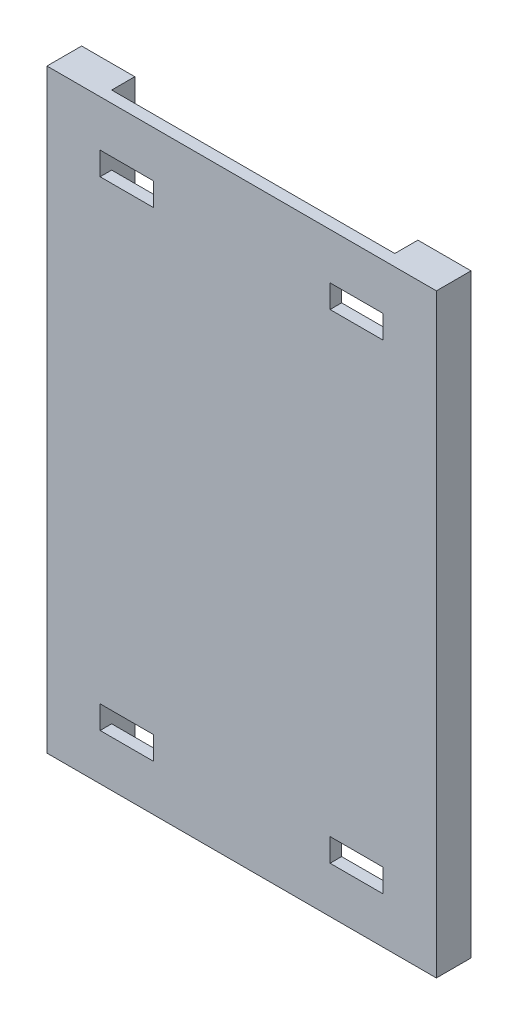
ISO-10303-21;
HEADER;
FILE_DESCRIPTION(('STEP AP214'),'2;1');
FILE_NAME('part.step','',(''),(''),'','','');
FILE_SCHEMA(('AUTOMOTIVE_DESIGN { 1 0 10303 214 1 1 1 1 }'));
ENDSEC;
DATA;
#1=APPLICATION_CONTEXT('core data for automotive mechanical design processes');
#2=APPLICATION_PROTOCOL_DEFINITION('international standard','automotive_design',2000,#1);
#3=PRODUCT_CONTEXT('',#1,'mechanical');
#4=PRODUCT('Part','Part','',(#3));
#5=PRODUCT_RELATED_PRODUCT_CATEGORY('part','',(#4));
#6=PRODUCT_DEFINITION_FORMATION('','',#4);
#7=PRODUCT_DEFINITION_CONTEXT('part definition',#1,'design');
#8=PRODUCT_DEFINITION('design','',#6,#7);
#9=PRODUCT_DEFINITION_SHAPE('','',#8);
#10=(LENGTH_UNIT() NAMED_UNIT(*) SI_UNIT(.MILLI.,.METRE.));
#11=(NAMED_UNIT(*) PLANE_ANGLE_UNIT() SI_UNIT($,.RADIAN.));
#12=(NAMED_UNIT(*) SI_UNIT($,.STERADIAN.) SOLID_ANGLE_UNIT());
#13=UNCERTAINTY_MEASURE_WITH_UNIT(LENGTH_MEASURE(1.E-05),#10,'distance_accuracy_value','');
#14=(GEOMETRIC_REPRESENTATION_CONTEXT(3) GLOBAL_UNCERTAINTY_ASSIGNED_CONTEXT((#13)) GLOBAL_UNIT_ASSIGNED_CONTEXT((#10,
#11,#12)) REPRESENTATION_CONTEXT('',''));
#15=CARTESIAN_POINT('',(0.,0.,0.));
#16=DIRECTION('',(0.,0.,1.));
#17=DIRECTION('',(1.,0.,0.));
#18=AXIS2_PLACEMENT_3D('',#15,#16,#17);
#19=CARTESIAN_POINT('',(0.,0.,-10.));
#20=DIRECTION('',(0.,0.,-1.));
#21=DIRECTION('',(-1.,0.,0.));
#22=AXIS2_PLACEMENT_3D('',#19,#20,#21);
#23=PLANE('',#22);
#24=DIRECTION('',(-1.,0.,0.));
#25=VECTOR('',#24,1.);
#26=CARTESIAN_POINT('',(69.,50.,-10.));
#27=LINE('',#26,#25);
#28=CARTESIAN_POINT('',(23.,50.,-10.));
#29=VERTEX_POINT('',#28);
#30=CARTESIAN_POINT('',(-221.999999999998,50.,-10.));
#31=VERTEX_POINT('',#30);
#32=EDGE_CURVE('E58',#29,#31,#27,.T.);
#33=ORIENTED_EDGE('',*,*,#32,.F.);
#34=DIRECTION('',(0.,1.,0.));
#35=VECTOR('',#34,1.);
#36=CARTESIAN_POINT('',(23.,-465.000000000016,-10.));
#37=LINE('',#36,#35);
#38=CARTESIAN_POINT('',(23.,10.,-10.));
#39=VERTEX_POINT('',#38);
#40=EDGE_CURVE('E225',#39,#29,#37,.T.);
#41=ORIENTED_EDGE('',*,*,#40,.F.);
#42=DIRECTION('',(-1.,0.,0.));
#43=VECTOR('',#42,1.);
#44=CARTESIAN_POINT('',(23.,10.,-10.));
#45=LINE('',#44,#43);
#46=CARTESIAN_POINT('',(-23.,10.,-10.));
#47=VERTEX_POINT('',#46);
#48=EDGE_CURVE('E251',#39,#47,#45,.T.);
#49=ORIENTED_EDGE('',*,*,#48,.T.);
#50=DIRECTION('',(0.,-1.,0.));
#51=VECTOR('',#50,1.);
#52=CARTESIAN_POINT('',(-23.,10.,-10.));
#53=LINE('',#52,#51);
#54=CARTESIAN_POINT('',(-23.,-10.,-10.));
#55=VERTEX_POINT('',#54);
#56=EDGE_CURVE('E254',#47,#55,#53,.T.);
#57=ORIENTED_EDGE('',*,*,#56,.T.);
#58=DIRECTION('',(1.,0.,0.));
#59=VECTOR('',#58,1.);
#60=CARTESIAN_POINT('',(-23.,-10.,-10.));
#61=LINE('',#60,#59);
#62=CARTESIAN_POINT('',(23.,-10.,-10.));
#63=VERTEX_POINT('',#62);
#64=EDGE_CURVE('E258',#55,#63,#61,.T.);
#65=ORIENTED_EDGE('',*,*,#64,.T.);
#66=CARTESIAN_POINT('',(23.0000000000072,-405.000000000016,-10.));
#67=VERTEX_POINT('',#66);
#68=EDGE_CURVE('E223',#67,#63,#37,.T.);
#69=ORIENTED_EDGE('',*,*,#68,.F.);
#70=DIRECTION('',(-1.,0.,0.));
#71=VECTOR('',#70,1.);
#72=CARTESIAN_POINT('',(23.0000000000072,-405.000000000016,-10.));
#73=LINE('',#72,#71);
#74=CARTESIAN_POINT('',(-22.9999999999928,-405.000000000016,-10.));
#75=VERTEX_POINT('',#74);
#76=EDGE_CURVE('E311',#67,#75,#73,.T.);
#77=ORIENTED_EDGE('',*,*,#76,.T.);
#78=DIRECTION('',(0.,-1.,0.));
#79=VECTOR('',#78,1.);
#80=CARTESIAN_POINT('',(-22.9999999999928,-405.000000000016,-10.));
#81=LINE('',#80,#79);
#82=CARTESIAN_POINT('',(-22.9999999999928,-425.000000000016,-10.));
#83=VERTEX_POINT('',#82);
#84=EDGE_CURVE('E315',#75,#83,#81,.T.);
#85=ORIENTED_EDGE('',*,*,#84,.T.);
#86=DIRECTION('',(1.,0.,0.));
#87=VECTOR('',#86,1.);
#88=CARTESIAN_POINT('',(-22.9999999999928,-425.000000000016,-10.));
#89=LINE('',#88,#87);
#90=CARTESIAN_POINT('',(23.0000000000072,-425.000000000016,-10.));
#91=VERTEX_POINT('',#90);
#92=EDGE_CURVE('E309',#83,#91,#89,.T.);
#93=ORIENTED_EDGE('',*,*,#92,.T.);
#94=CARTESIAN_POINT('',(23.,-465.000000000016,-10.));
#95=VERTEX_POINT('',#94);
#96=EDGE_CURVE('E51',#95,#91,#37,.T.);
#97=ORIENTED_EDGE('',*,*,#96,.F.);
#98=DIRECTION('',(1.,0.,0.));
#99=VECTOR('',#98,1.);
#100=CARTESIAN_POINT('',(69.,-465.000000000016,-10.));
#101=LINE('',#100,#99);
#102=CARTESIAN_POINT('',(-221.999999999998,-465.000000000016,-10.));
#103=VERTEX_POINT('',#102);
#104=EDGE_CURVE('E366',#103,#95,#101,.T.);
#105=ORIENTED_EDGE('',*,*,#104,.F.);
#106=DIRECTION('',(0.,-1.,0.));
#107=VECTOR('',#106,1.);
#108=CARTESIAN_POINT('',(-221.999999999998,-465.000000000016,-10.));
#109=LINE('',#108,#107);
#110=CARTESIAN_POINT('',(-221.999999999992,-425.000000000016,-10.));
#111=VERTEX_POINT('',#110);
#112=EDGE_CURVE('E42',#111,#103,#109,.T.);
#113=ORIENTED_EDGE('',*,*,#112,.F.);
#114=DIRECTION('',(1.,0.,0.));
#115=VECTOR('',#114,1.);
#116=CARTESIAN_POINT('',(-221.999999999992,-425.000000000016,-10.));
#117=LINE('',#116,#115);
#118=CARTESIAN_POINT('',(-175.999999999992,-425.000000000016,-10.));
#119=VERTEX_POINT('',#118);
#120=EDGE_CURVE('E337',#111,#119,#117,.T.);
#121=ORIENTED_EDGE('',*,*,#120,.T.);
#122=DIRECTION('',(0.,1.,0.));
#123=VECTOR('',#122,1.);
#124=CARTESIAN_POINT('',(-175.999999999992,-425.000000000016,-10.));
#125=LINE('',#124,#123);
#126=CARTESIAN_POINT('',(-175.999999999992,-405.000000000016,-10.));
#127=VERTEX_POINT('',#126);
#128=EDGE_CURVE('E340',#119,#127,#125,.T.);
#129=ORIENTED_EDGE('',*,*,#128,.T.);
#130=DIRECTION('',(-1.,0.,0.));
#131=VECTOR('',#130,1.);
#132=CARTESIAN_POINT('',(-175.999999999992,-405.000000000016,-10.));
#133=LINE('',#132,#131);
#134=CARTESIAN_POINT('',(-221.999999999992,-405.000000000016,-10.));
#135=VERTEX_POINT('',#134);
#136=EDGE_CURVE('E344',#127,#135,#133,.T.);
#137=ORIENTED_EDGE('',*,*,#136,.T.);
#138=CARTESIAN_POINT('',(-221.999999999998,-10.,-10.));
#139=VERTEX_POINT('',#138);
#140=EDGE_CURVE('E11',#139,#135,#109,.T.);
#141=ORIENTED_EDGE('',*,*,#140,.F.);
#142=DIRECTION('',(1.,0.,0.));
#143=VECTOR('',#142,1.);
#144=CARTESIAN_POINT('',(-221.999999999998,-10.,-10.));
#145=LINE('',#144,#143);
#146=CARTESIAN_POINT('',(-175.999999999998,-10.,-10.));
#147=VERTEX_POINT('',#146);
#148=EDGE_CURVE('E283',#139,#147,#145,.T.);
#149=ORIENTED_EDGE('',*,*,#148,.T.);
#150=DIRECTION('',(0.,1.,0.));
#151=VECTOR('',#150,1.);
#152=CARTESIAN_POINT('',(-175.999999999998,-10.,-10.));
#153=LINE('',#152,#151);
#154=CARTESIAN_POINT('',(-175.999999999998,10.,-10.));
#155=VERTEX_POINT('',#154);
#156=EDGE_CURVE('E287',#147,#155,#153,.T.);
#157=ORIENTED_EDGE('',*,*,#156,.T.);
#158=DIRECTION('',(-1.,0.,0.));
#159=VECTOR('',#158,1.);
#160=CARTESIAN_POINT('',(-175.999999999998,10.,-10.));
#161=LINE('',#160,#159);
#162=CARTESIAN_POINT('',(-221.999999999998,10.,-10.));
#163=VERTEX_POINT('',#162);
#164=EDGE_CURVE('E280',#155,#163,#161,.T.);
#165=ORIENTED_EDGE('',*,*,#164,.T.);
#166=EDGE_CURVE('E44',#31,#163,#109,.T.);
#167=ORIENTED_EDGE('',*,*,#166,.F.);
#168=EDGE_LOOP('',(#33,#41,#49,#57,#65,#69,#77,#85,#93,#97,#105,#113,#121,#129,#137,#141,#149,
#157,#165,#167));
#169=FACE_BOUND('',#168,.T.);
#170=ADVANCED_FACE('F33',(#169),#23,.T.);
#171=CARTESIAN_POINT('',(69.,50.,-10.));
#172=DIRECTION('',(1.,0.,0.));
#173=DIRECTION('',(0.,1.,0.));
#174=AXIS2_PLACEMENT_3D('',#171,#172,#173);
#175=PLANE('',#174);
#176=DIRECTION('',(0.,1.,0.));
#177=VECTOR('',#176,1.);
#178=CARTESIAN_POINT('',(69.,50.,0.));
#179=LINE('',#178,#177);
#180=CARTESIAN_POINT('',(69.,-465.000000000016,0.));
#181=VERTEX_POINT('',#180);
#182=CARTESIAN_POINT('',(69.,50.,0.));
#183=VERTEX_POINT('',#182);
#184=EDGE_CURVE('E203',#181,#183,#179,.T.);
#185=ORIENTED_EDGE('',*,*,#184,.F.);
#186=DIRECTION('',(0.,0.,1.));
#187=VECTOR('',#186,1.);
#188=CARTESIAN_POINT('',(69.,-465.000000000016,-10.));
#189=LINE('',#188,#187);
#190=CARTESIAN_POINT('',(69.,-465.000000000016,-30.));
#191=VERTEX_POINT('',#190);
#192=EDGE_CURVE('E198',#191,#181,#189,.T.);
#193=ORIENTED_EDGE('',*,*,#192,.F.);
#194=DIRECTION('',(0.,-1.,0.));
#195=VECTOR('',#194,1.);
#196=CARTESIAN_POINT('',(69.,-465.000000000016,-30.));
#197=LINE('',#196,#195);
#198=CARTESIAN_POINT('',(69.,50.,-30.));
#199=VERTEX_POINT('',#198);
#200=EDGE_CURVE('E201',#199,#191,#197,.T.);
#201=ORIENTED_EDGE('',*,*,#200,.F.);
#202=DIRECTION('',(0.,0.,1.));
#203=VECTOR('',#202,1.);
#204=CARTESIAN_POINT('',(69.,50.,-10.));
#205=LINE('',#204,#203);
#206=EDGE_CURVE('E37',#199,#183,#205,.T.);
#207=ORIENTED_EDGE('',*,*,#206,.T.);
#208=EDGE_LOOP('',(#185,#193,#201,#207));
#209=FACE_BOUND('',#208,.T.);
#210=ADVANCED_FACE('F35',(#209),#175,.T.);
#211=CARTESIAN_POINT('',(69.,-465.000000000016,-10.));
#212=DIRECTION('',(0.,-1.,0.));
#213=DIRECTION('',(1.,0.,0.));
#214=AXIS2_PLACEMENT_3D('',#211,#212,#213);
#215=PLANE('',#214);
#216=DIRECTION('',(1.,0.,0.));
#217=VECTOR('',#216,1.);
#218=CARTESIAN_POINT('',(69.,-465.000000000016,0.));
#219=LINE('',#218,#217);
#220=CARTESIAN_POINT('',(-267.999999999992,-465.000000000016,0.));
#221=VERTEX_POINT('',#220);
#222=EDGE_CURVE('E367',#221,#181,#219,.T.);
#223=ORIENTED_EDGE('',*,*,#222,.F.);
#224=DIRECTION('',(0.,0.,1.));
#225=VECTOR('',#224,1.);
#226=CARTESIAN_POINT('',(-267.999999999992,-465.000000000016,-10.));
#227=LINE('',#226,#225);
#228=CARTESIAN_POINT('',(-267.999999999992,-465.000000000016,-30.));
#229=VERTEX_POINT('',#228);
#230=EDGE_CURVE('E207',#229,#221,#227,.T.);
#231=ORIENTED_EDGE('',*,*,#230,.F.);
#232=DIRECTION('',(-1.,0.,0.));
#233=VECTOR('',#232,1.);
#234=CARTESIAN_POINT('',(-267.999999999992,-465.000000000016,-30.));
#235=LINE('',#234,#233);
#236=CARTESIAN_POINT('',(-221.999999999998,-465.000000000016,-30.));
#237=VERTEX_POINT('',#236);
#238=EDGE_CURVE('E240',#237,#229,#235,.T.);
#239=ORIENTED_EDGE('',*,*,#238,.F.);
#240=DIRECTION('',(0.,0.,1.));
#241=VECTOR('',#240,1.);
#242=CARTESIAN_POINT('',(-221.999999999998,-465.000000000016,-30.));
#243=LINE('',#242,#241);
#244=EDGE_CURVE('E242',#237,#103,#243,.T.);
#245=ORIENTED_EDGE('',*,*,#244,.T.);
#246=ORIENTED_EDGE('',*,*,#104,.T.);
#247=DIRECTION('',(0.,0.,1.));
#248=VECTOR('',#247,1.);
#249=CARTESIAN_POINT('',(23.,-465.000000000016,-30.));
#250=LINE('',#249,#248);
#251=CARTESIAN_POINT('',(23.,-465.000000000016,-30.));
#252=VERTEX_POINT('',#251);
#253=EDGE_CURVE('E213',#252,#95,#250,.T.);
#254=ORIENTED_EDGE('',*,*,#253,.F.);
#255=DIRECTION('',(-1.,0.,0.));
#256=VECTOR('',#255,1.);
#257=CARTESIAN_POINT('',(69.,-465.000000000016,-30.));
#258=LINE('',#257,#256);
#259=EDGE_CURVE('E210',#191,#252,#258,.T.);
#260=ORIENTED_EDGE('',*,*,#259,.F.);
#261=ORIENTED_EDGE('',*,*,#192,.T.);
#262=EDGE_LOOP('',(#223,#231,#239,#245,#246,#254,#260,#261));
#263=FACE_BOUND('',#262,.T.);
#264=ADVANCED_FACE('F211',(#263),#215,.T.);
#265=CARTESIAN_POINT('',(-267.999999999992,50.,-10.));
#266=DIRECTION('',(-1.,0.,0.));
#267=DIRECTION('',(0.,-1.,0.));
#268=AXIS2_PLACEMENT_3D('',#265,#266,#267);
#269=PLANE('',#268);
#270=DIRECTION('',(0.,-1.,0.));
#271=VECTOR('',#270,1.);
#272=CARTESIAN_POINT('',(-267.999999999992,50.,0.));
#273=LINE('',#272,#271);
#274=CARTESIAN_POINT('',(-267.999999999992,50.,0.));
#275=VERTEX_POINT('',#274);
#276=EDGE_CURVE('E373',#275,#221,#273,.T.);
#277=ORIENTED_EDGE('',*,*,#276,.F.);
#278=DIRECTION('',(0.,0.,1.));
#279=VECTOR('',#278,1.);
#280=CARTESIAN_POINT('',(-267.999999999992,50.,-10.));
#281=LINE('',#280,#279);
#282=CARTESIAN_POINT('',(-267.999999999992,50.,-30.));
#283=VERTEX_POINT('',#282);
#284=EDGE_CURVE('E377',#283,#275,#281,.T.);
#285=ORIENTED_EDGE('',*,*,#284,.F.);
#286=DIRECTION('',(0.,1.,0.));
#287=VECTOR('',#286,1.);
#288=CARTESIAN_POINT('',(-267.999999999992,-465.000000000016,-30.));
#289=LINE('',#288,#287);
#290=EDGE_CURVE('E233',#229,#283,#289,.T.);
#291=ORIENTED_EDGE('',*,*,#290,.F.);
#292=ORIENTED_EDGE('',*,*,#230,.T.);
#293=EDGE_LOOP('',(#277,#285,#291,#292));
#294=FACE_BOUND('',#293,.T.);
#295=ADVANCED_FACE('F392',(#294),#269,.T.);
#296=CARTESIAN_POINT('',(69.,50.,-10.));
#297=DIRECTION('',(0.,1.,0.));
#298=DIRECTION('',(-1.,0.,0.));
#299=AXIS2_PLACEMENT_3D('',#296,#297,#298);
#300=PLANE('',#299);
#301=DIRECTION('',(-1.,0.,0.));
#302=VECTOR('',#301,1.);
#303=CARTESIAN_POINT('',(69.,50.,0.));
#304=LINE('',#303,#302);
#305=EDGE_CURVE('E370',#183,#275,#304,.T.);
#306=ORIENTED_EDGE('',*,*,#305,.F.);
#307=ORIENTED_EDGE('',*,*,#206,.F.);
#308=DIRECTION('',(1.,0.,0.));
#309=VECTOR('',#308,1.);
#310=CARTESIAN_POINT('',(69.,50.,-30.));
#311=LINE('',#310,#309);
#312=CARTESIAN_POINT('',(23.,50.,-30.));
#313=VERTEX_POINT('',#312);
#314=EDGE_CURVE('E221',#313,#199,#311,.T.);
#315=ORIENTED_EDGE('',*,*,#314,.F.);
#316=DIRECTION('',(0.,0.,1.));
#317=VECTOR('',#316,1.);
#318=CARTESIAN_POINT('',(23.,50.,-30.));
#319=LINE('',#318,#317);
#320=EDGE_CURVE('E228',#313,#29,#319,.T.);
#321=ORIENTED_EDGE('',*,*,#320,.T.);
#322=ORIENTED_EDGE('',*,*,#32,.T.);
#323=DIRECTION('',(0.,0.,1.));
#324=VECTOR('',#323,1.);
#325=CARTESIAN_POINT('',(-221.999999999998,50.,-30.));
#326=LINE('',#325,#324);
#327=CARTESIAN_POINT('',(-221.999999999998,50.,-30.));
#328=VERTEX_POINT('',#327);
#329=EDGE_CURVE('E247',#328,#31,#326,.T.);
#330=ORIENTED_EDGE('',*,*,#329,.F.);
#331=DIRECTION('',(1.,0.,0.));
#332=VECTOR('',#331,1.);
#333=CARTESIAN_POINT('',(-267.999999999992,50.,-30.));
#334=LINE('',#333,#332);
#335=EDGE_CURVE('E236',#283,#328,#334,.T.);
#336=ORIENTED_EDGE('',*,*,#335,.F.);
#337=ORIENTED_EDGE('',*,*,#284,.T.);
#338=EDGE_LOOP('',(#306,#307,#315,#321,#322,#330,#336,#337));
#339=FACE_BOUND('',#338,.T.);
#340=ADVANCED_FACE('F382',(#339),#300,.T.);
#341=CARTESIAN_POINT('',(0.,0.,0.));
#342=DIRECTION('',(0.,0.,-1.));
#343=DIRECTION('',(-1.,0.,0.));
#344=AXIS2_PLACEMENT_3D('',#341,#342,#343);
#345=PLANE('',#344);
#346=DIRECTION('',(0.,-1.,0.));
#347=VECTOR('',#346,1.);
#348=CARTESIAN_POINT('',(-23.,10.,0.));
#349=LINE('',#348,#347);
#350=CARTESIAN_POINT('',(-23.,10.,0.));
#351=VERTEX_POINT('',#350);
#352=CARTESIAN_POINT('',(-23.,-10.,0.));
#353=VERTEX_POINT('',#352);
#354=EDGE_CURVE('E263',#351,#353,#349,.T.);
#355=ORIENTED_EDGE('',*,*,#354,.F.);
#356=DIRECTION('',(-1.,0.,0.));
#357=VECTOR('',#356,1.);
#358=CARTESIAN_POINT('',(23.,10.,0.));
#359=LINE('',#358,#357);
#360=CARTESIAN_POINT('',(23.,10.,0.));
#361=VERTEX_POINT('',#360);
#362=EDGE_CURVE('E250',#361,#351,#359,.T.);
#363=ORIENTED_EDGE('',*,*,#362,.F.);
#364=DIRECTION('',(0.,1.,0.));
#365=VECTOR('',#364,1.);
#366=CARTESIAN_POINT('',(23.,-10.,0.));
#367=LINE('',#366,#365);
#368=CARTESIAN_POINT('',(23.,-10.,0.));
#369=VERTEX_POINT('',#368);
#370=EDGE_CURVE('E255',#369,#361,#367,.T.);
#371=ORIENTED_EDGE('',*,*,#370,.F.);
#372=DIRECTION('',(1.,0.,0.));
#373=VECTOR('',#372,1.);
#374=CARTESIAN_POINT('',(-23.,-10.,0.));
#375=LINE('',#374,#373);
#376=EDGE_CURVE('E266',#353,#369,#375,.T.);
#377=ORIENTED_EDGE('',*,*,#376,.F.);
#378=EDGE_LOOP('',(#355,#363,#371,#377));
#379=FACE_BOUND('',#378,.T.);
#380=DIRECTION('',(0.,-1.,0.));
#381=VECTOR('',#380,1.);
#382=CARTESIAN_POINT('',(-221.999999999998,10.,0.));
#383=LINE('',#382,#381);
#384=CARTESIAN_POINT('',(-221.999999999998,10.,0.));
#385=VERTEX_POINT('',#384);
#386=CARTESIAN_POINT('',(-221.999999999998,-10.,0.));
#387=VERTEX_POINT('',#386);
#388=EDGE_CURVE('E292',#385,#387,#383,.T.);
#389=ORIENTED_EDGE('',*,*,#388,.F.);
#390=DIRECTION('',(-1.,0.,0.));
#391=VECTOR('',#390,1.);
#392=CARTESIAN_POINT('',(-175.999999999998,10.,0.));
#393=LINE('',#392,#391);
#394=CARTESIAN_POINT('',(-175.999999999998,10.,0.));
#395=VERTEX_POINT('',#394);
#396=EDGE_CURVE('E273',#395,#385,#393,.T.);
#397=ORIENTED_EDGE('',*,*,#396,.F.);
#398=DIRECTION('',(0.,1.,0.));
#399=VECTOR('',#398,1.);
#400=CARTESIAN_POINT('',(-175.999999999998,-10.,0.));
#401=LINE('',#400,#399);
#402=CARTESIAN_POINT('',(-175.999999999998,-10.,0.));
#403=VERTEX_POINT('',#402);
#404=EDGE_CURVE('E284',#403,#395,#401,.T.);
#405=ORIENTED_EDGE('',*,*,#404,.F.);
#406=DIRECTION('',(1.,0.,0.));
#407=VECTOR('',#406,1.);
#408=CARTESIAN_POINT('',(-221.999999999998,-10.,0.));
#409=LINE('',#408,#407);
#410=EDGE_CURVE('E295',#387,#403,#409,.T.);
#411=ORIENTED_EDGE('',*,*,#410,.F.);
#412=EDGE_LOOP('',(#389,#397,#405,#411));
#413=FACE_BOUND('',#412,.T.);
#414=DIRECTION('',(0.,1.,0.));
#415=VECTOR('',#414,1.);
#416=CARTESIAN_POINT('',(23.0000000000072,-425.000000000016,0.));
#417=LINE('',#416,#415);
#418=CARTESIAN_POINT('',(23.0000000000072,-425.000000000016,0.));
#419=VERTEX_POINT('',#418);
#420=CARTESIAN_POINT('',(23.0000000000072,-405.000000000016,0.));
#421=VERTEX_POINT('',#420);
#422=EDGE_CURVE('E320',#419,#421,#417,.T.);
#423=ORIENTED_EDGE('',*,*,#422,.F.);
#424=DIRECTION('',(1.,0.,0.));
#425=VECTOR('',#424,1.);
#426=CARTESIAN_POINT('',(-22.9999999999928,-425.000000000016,0.));
#427=LINE('',#426,#425);
#428=CARTESIAN_POINT('',(-22.9999999999928,-425.000000000016,0.));
#429=VERTEX_POINT('',#428);
#430=EDGE_CURVE('E302',#429,#419,#427,.T.);
#431=ORIENTED_EDGE('',*,*,#430,.F.);
#432=DIRECTION('',(0.,-1.,0.));
#433=VECTOR('',#432,1.);
#434=CARTESIAN_POINT('',(-22.9999999999928,-405.000000000016,0.));
#435=LINE('',#434,#433);
#436=CARTESIAN_POINT('',(-22.9999999999928,-405.000000000016,0.));
#437=VERTEX_POINT('',#436);
#438=EDGE_CURVE('E312',#437,#429,#435,.T.);
#439=ORIENTED_EDGE('',*,*,#438,.F.);
#440=DIRECTION('',(-1.,0.,0.));
#441=VECTOR('',#440,1.);
#442=CARTESIAN_POINT('',(23.0000000000072,-405.000000000016,0.));
#443=LINE('',#442,#441);
#444=EDGE_CURVE('E323',#421,#437,#443,.T.);
#445=ORIENTED_EDGE('',*,*,#444,.F.);
#446=EDGE_LOOP('',(#423,#431,#439,#445));
#447=FACE_BOUND('',#446,.T.);
#448=DIRECTION('',(0.,1.,0.));
#449=VECTOR('',#448,1.);
#450=CARTESIAN_POINT('',(-175.999999999992,-425.000000000016,0.));
#451=LINE('',#450,#449);
#452=CARTESIAN_POINT('',(-175.999999999992,-425.000000000016,0.));
#453=VERTEX_POINT('',#452);
#454=CARTESIAN_POINT('',(-175.999999999992,-405.000000000016,0.));
#455=VERTEX_POINT('',#454);
#456=EDGE_CURVE('E349',#453,#455,#451,.T.);
#457=ORIENTED_EDGE('',*,*,#456,.F.);
#458=DIRECTION('',(1.,0.,0.));
#459=VECTOR('',#458,1.);
#460=CARTESIAN_POINT('',(-221.999999999992,-425.000000000016,0.));
#461=LINE('',#460,#459);
#462=CARTESIAN_POINT('',(-221.999999999992,-425.000000000016,0.));
#463=VERTEX_POINT('',#462);
#464=EDGE_CURVE('E330',#463,#453,#461,.T.);
#465=ORIENTED_EDGE('',*,*,#464,.F.);
#466=DIRECTION('',(0.,-1.,0.));
#467=VECTOR('',#466,1.);
#468=CARTESIAN_POINT('',(-221.999999999992,-405.000000000016,0.));
#469=LINE('',#468,#467);
#470=CARTESIAN_POINT('',(-221.999999999992,-405.000000000016,0.));
#471=VERTEX_POINT('',#470);
#472=EDGE_CURVE('E341',#471,#463,#469,.T.);
#473=ORIENTED_EDGE('',*,*,#472,.F.);
#474=DIRECTION('',(-1.,0.,0.));
#475=VECTOR('',#474,1.);
#476=CARTESIAN_POINT('',(-175.999999999992,-405.000000000016,0.));
#477=LINE('',#476,#475);
#478=EDGE_CURVE('E352',#455,#471,#477,.T.);
#479=ORIENTED_EDGE('',*,*,#478,.F.);
#480=EDGE_LOOP('',(#457,#465,#473,#479));
#481=FACE_BOUND('',#480,.T.);
#482=ORIENTED_EDGE('',*,*,#184,.T.);
#483=ORIENTED_EDGE('',*,*,#305,.T.);
#484=ORIENTED_EDGE('',*,*,#276,.T.);
#485=ORIENTED_EDGE('',*,*,#222,.T.);
#486=EDGE_LOOP('',(#482,#483,#484,#485));
#487=FACE_BOUND('',#486,.T.);
#488=ADVANCED_FACE('F384',(#379,#413,#447,#481,#487),#345,.F.);
#489=CARTESIAN_POINT('',(-221.999999999992,-425.000000000016,-10.));
#490=DIRECTION('',(0.,-1.,0.));
#491=DIRECTION('',(0.,0.,-1.));
#492=AXIS2_PLACEMENT_3D('',#489,#490,#491);
#493=PLANE('',#492);
#494=ORIENTED_EDGE('',*,*,#464,.T.);
#495=DIRECTION('',(0.,0.,1.));
#496=VECTOR('',#495,1.);
#497=CARTESIAN_POINT('',(-175.999999999992,-425.000000000016,-10.));
#498=LINE('',#497,#496);
#499=EDGE_CURVE('E347',#119,#453,#498,.T.);
#500=ORIENTED_EDGE('',*,*,#499,.F.);
#501=ORIENTED_EDGE('',*,*,#120,.F.);
#502=DIRECTION('',(0.,0.,1.));
#503=VECTOR('',#502,1.);
#504=CARTESIAN_POINT('',(-221.999999999992,-425.000000000016,-10.));
#505=LINE('',#504,#503);
#506=EDGE_CURVE('E357',#111,#463,#505,.T.);
#507=ORIENTED_EDGE('',*,*,#506,.T.);
#508=EDGE_LOOP('',(#494,#500,#501,#507));
#509=FACE_BOUND('',#508,.T.);
#510=ADVANCED_FACE('F420',(#509),#493,.F.);
#511=CARTESIAN_POINT('',(-221.999999999992,-405.000000000016,-10.));
#512=DIRECTION('',(-1.,0.,0.));
#513=DIRECTION('',(0.,0.,1.));
#514=AXIS2_PLACEMENT_3D('',#511,#512,#513);
#515=PLANE('',#514);
#516=ORIENTED_EDGE('',*,*,#472,.T.);
#517=ORIENTED_EDGE('',*,*,#506,.F.);
#518=ORIENTED_EDGE('',*,*,#112,.T.);
#519=ORIENTED_EDGE('',*,*,#244,.F.);
#520=DIRECTION('',(0.,-1.,0.));
#521=VECTOR('',#520,1.);
#522=CARTESIAN_POINT('',(-221.999999999998,-465.000000000016,-30.));
#523=LINE('',#522,#521);
#524=EDGE_CURVE('E238',#328,#237,#523,.T.);
#525=ORIENTED_EDGE('',*,*,#524,.F.);
#526=ORIENTED_EDGE('',*,*,#329,.T.);
#527=ORIENTED_EDGE('',*,*,#166,.T.);
#528=DIRECTION('',(0.,0.,1.));
#529=VECTOR('',#528,1.);
#530=CARTESIAN_POINT('',(-221.999999999998,10.,-10.));
#531=LINE('',#530,#529);
#532=EDGE_CURVE('E290',#163,#385,#531,.T.);
#533=ORIENTED_EDGE('',*,*,#532,.T.);
#534=ORIENTED_EDGE('',*,*,#388,.T.);
#535=DIRECTION('',(0.,0.,1.));
#536=VECTOR('',#535,1.);
#537=CARTESIAN_POINT('',(-221.999999999998,-10.,-10.));
#538=LINE('',#537,#536);
#539=EDGE_CURVE('E305',#139,#387,#538,.T.);
#540=ORIENTED_EDGE('',*,*,#539,.F.);
#541=ORIENTED_EDGE('',*,*,#140,.T.);
#542=DIRECTION('',(0.,0.,1.));
#543=VECTOR('',#542,1.);
#544=CARTESIAN_POINT('',(-221.999999999992,-405.000000000016,-10.));
#545=LINE('',#544,#543);
#546=EDGE_CURVE('E359',#135,#471,#545,.T.);
#547=ORIENTED_EDGE('',*,*,#546,.T.);
#548=EDGE_LOOP('',(#516,#517,#518,#519,#525,#526,#527,#533,#534,#540,#541,#547));
#549=FACE_BOUND('',#548,.T.);
#550=ADVANCED_FACE('F395',(#549),#515,.F.);
#551=CARTESIAN_POINT('',(-175.999999999992,-405.000000000016,-10.));
#552=DIRECTION('',(0.,1.,0.));
#553=DIRECTION('',(0.,0.,1.));
#554=AXIS2_PLACEMENT_3D('',#551,#552,#553);
#555=PLANE('',#554);
#556=ORIENTED_EDGE('',*,*,#478,.T.);
#557=ORIENTED_EDGE('',*,*,#546,.F.);
#558=ORIENTED_EDGE('',*,*,#136,.F.);
#559=DIRECTION('',(0.,0.,1.));
#560=VECTOR('',#559,1.);
#561=CARTESIAN_POINT('',(-175.999999999992,-405.000000000016,-10.));
#562=LINE('',#561,#560);
#563=EDGE_CURVE('E361',#127,#455,#562,.T.);
#564=ORIENTED_EDGE('',*,*,#563,.T.);
#565=EDGE_LOOP('',(#556,#557,#558,#564));
#566=FACE_BOUND('',#565,.T.);
#567=ADVANCED_FACE('F435',(#566),#555,.F.);
#568=CARTESIAN_POINT('',(-175.999999999992,-425.000000000016,-10.));
#569=DIRECTION('',(1.,0.,0.));
#570=DIRECTION('',(0.,0.,-1.));
#571=AXIS2_PLACEMENT_3D('',#568,#569,#570);
#572=PLANE('',#571);
#573=ORIENTED_EDGE('',*,*,#456,.T.);
#574=ORIENTED_EDGE('',*,*,#563,.F.);
#575=ORIENTED_EDGE('',*,*,#128,.F.);
#576=ORIENTED_EDGE('',*,*,#499,.T.);
#577=EDGE_LOOP('',(#573,#574,#575,#576));
#578=FACE_BOUND('',#577,.T.);
#579=ADVANCED_FACE('F429',(#578),#572,.F.);
#580=CARTESIAN_POINT('',(-22.9999999999928,-425.000000000016,-10.));
#581=DIRECTION('',(0.,-1.,0.));
#582=DIRECTION('',(0.,0.,-1.));
#583=AXIS2_PLACEMENT_3D('',#580,#581,#582);
#584=PLANE('',#583);
#585=ORIENTED_EDGE('',*,*,#430,.T.);
#586=DIRECTION('',(0.,0.,1.));
#587=VECTOR('',#586,1.);
#588=CARTESIAN_POINT('',(23.0000000000072,-425.000000000016,-10.));
#589=LINE('',#588,#587);
#590=EDGE_CURVE('E318',#91,#419,#589,.T.);
#591=ORIENTED_EDGE('',*,*,#590,.F.);
#592=ORIENTED_EDGE('',*,*,#92,.F.);
#593=DIRECTION('',(0.,0.,1.));
#594=VECTOR('',#593,1.);
#595=CARTESIAN_POINT('',(-22.9999999999928,-425.000000000016,-10.));
#596=LINE('',#595,#594);
#597=EDGE_CURVE('E328',#83,#429,#596,.T.);
#598=ORIENTED_EDGE('',*,*,#597,.T.);
#599=EDGE_LOOP('',(#585,#591,#592,#598));
#600=FACE_BOUND('',#599,.T.);
#601=ADVANCED_FACE('F414',(#600),#584,.F.);
#602=CARTESIAN_POINT('',(-22.9999999999928,-405.000000000016,-10.));
#603=DIRECTION('',(-1.,0.,0.));
#604=DIRECTION('',(0.,0.,1.));
#605=AXIS2_PLACEMENT_3D('',#602,#603,#604);
#606=PLANE('',#605);
#607=ORIENTED_EDGE('',*,*,#438,.T.);
#608=ORIENTED_EDGE('',*,*,#597,.F.);
#609=ORIENTED_EDGE('',*,*,#84,.F.);
#610=DIRECTION('',(0.,0.,1.));
#611=VECTOR('',#610,1.);
#612=CARTESIAN_POINT('',(-22.9999999999928,-405.000000000016,-10.));
#613=LINE('',#612,#611);
#614=EDGE_CURVE('E331',#75,#437,#613,.T.);
#615=ORIENTED_EDGE('',*,*,#614,.T.);
#616=EDGE_LOOP('',(#607,#608,#609,#615));
#617=FACE_BOUND('',#616,.T.);
#618=ADVANCED_FACE('F411',(#617),#606,.F.);
#619=CARTESIAN_POINT('',(23.0000000000072,-405.000000000016,-10.));
#620=DIRECTION('',(0.,1.,0.));
#621=DIRECTION('',(0.,0.,1.));
#622=AXIS2_PLACEMENT_3D('',#619,#620,#621);
#623=PLANE('',#622);
#624=ORIENTED_EDGE('',*,*,#444,.T.);
#625=ORIENTED_EDGE('',*,*,#614,.F.);
#626=ORIENTED_EDGE('',*,*,#76,.F.);
#627=DIRECTION('',(0.,0.,1.));
#628=VECTOR('',#627,1.);
#629=CARTESIAN_POINT('',(23.0000000000072,-405.000000000016,-10.));
#630=LINE('',#629,#628);
#631=EDGE_CURVE('E333',#67,#421,#630,.T.);
#632=ORIENTED_EDGE('',*,*,#631,.T.);
#633=EDGE_LOOP('',(#624,#625,#626,#632));
#634=FACE_BOUND('',#633,.T.);
#635=ADVANCED_FACE('F406',(#634),#623,.F.);
#636=CARTESIAN_POINT('',(23.0000000000072,-425.000000000016,-10.));
#637=DIRECTION('',(1.,0.,0.));
#638=DIRECTION('',(0.,0.,-1.));
#639=AXIS2_PLACEMENT_3D('',#636,#637,#638);
#640=PLANE('',#639);
#641=ORIENTED_EDGE('',*,*,#422,.T.);
#642=ORIENTED_EDGE('',*,*,#631,.F.);
#643=ORIENTED_EDGE('',*,*,#68,.T.);
#644=DIRECTION('',(0.,0.,1.));
#645=VECTOR('',#644,1.);
#646=CARTESIAN_POINT('',(23.,-10.,-10.));
#647=LINE('',#646,#645);
#648=EDGE_CURVE('E274',#63,#369,#647,.T.);
#649=ORIENTED_EDGE('',*,*,#648,.T.);
#650=ORIENTED_EDGE('',*,*,#370,.T.);
#651=DIRECTION('',(0.,0.,1.));
#652=VECTOR('',#651,1.);
#653=CARTESIAN_POINT('',(23.,10.,-10.));
#654=LINE('',#653,#652);
#655=EDGE_CURVE('E271',#39,#361,#654,.T.);
#656=ORIENTED_EDGE('',*,*,#655,.F.);
#657=ORIENTED_EDGE('',*,*,#40,.T.);
#658=ORIENTED_EDGE('',*,*,#320,.F.);
#659=DIRECTION('',(0.,1.,0.));
#660=VECTOR('',#659,1.);
#661=CARTESIAN_POINT('',(23.,-465.000000000016,-30.));
#662=LINE('',#661,#660);
#663=EDGE_CURVE('E216',#252,#313,#662,.T.);
#664=ORIENTED_EDGE('',*,*,#663,.F.);
#665=ORIENTED_EDGE('',*,*,#253,.T.);
#666=ORIENTED_EDGE('',*,*,#96,.T.);
#667=ORIENTED_EDGE('',*,*,#590,.T.);
#668=EDGE_LOOP('',(#641,#642,#643,#649,#650,#656,#657,#658,#664,#665,#666,#667));
#669=FACE_BOUND('',#668,.T.);
#670=ADVANCED_FACE('F399',(#669),#640,.F.);
#671=CARTESIAN_POINT('',(-175.999999999998,10.,-10.));
#672=DIRECTION('',(0.,1.,0.));
#673=DIRECTION('',(0.,0.,1.));
#674=AXIS2_PLACEMENT_3D('',#671,#672,#673);
#675=PLANE('',#674);
#676=ORIENTED_EDGE('',*,*,#396,.T.);
#677=ORIENTED_EDGE('',*,*,#532,.F.);
#678=ORIENTED_EDGE('',*,*,#164,.F.);
#679=DIRECTION('',(0.,0.,1.));
#680=VECTOR('',#679,1.);
#681=CARTESIAN_POINT('',(-175.999999999998,10.,-10.));
#682=LINE('',#681,#680);
#683=EDGE_CURVE('E300',#155,#395,#682,.T.);
#684=ORIENTED_EDGE('',*,*,#683,.T.);
#685=EDGE_LOOP('',(#676,#677,#678,#684));
#686=FACE_BOUND('',#685,.T.);
#687=ADVANCED_FACE('F449',(#686),#675,.F.);
#688=CARTESIAN_POINT('',(-175.999999999998,-10.,-10.));
#689=DIRECTION('',(1.,0.,0.));
#690=DIRECTION('',(0.,0.,-1.));
#691=AXIS2_PLACEMENT_3D('',#688,#689,#690);
#692=PLANE('',#691);
#693=ORIENTED_EDGE('',*,*,#404,.T.);
#694=ORIENTED_EDGE('',*,*,#683,.F.);
#695=ORIENTED_EDGE('',*,*,#156,.F.);
#696=DIRECTION('',(0.,0.,1.));
#697=VECTOR('',#696,1.);
#698=CARTESIAN_POINT('',(-175.999999999998,-10.,-10.));
#699=LINE('',#698,#697);
#700=EDGE_CURVE('E303',#147,#403,#699,.T.);
#701=ORIENTED_EDGE('',*,*,#700,.T.);
#702=EDGE_LOOP('',(#693,#694,#695,#701));
#703=FACE_BOUND('',#702,.T.);
#704=ADVANCED_FACE('F446',(#703),#692,.F.);
#705=CARTESIAN_POINT('',(-221.999999999998,-10.,-10.));
#706=DIRECTION('',(0.,-1.,0.));
#707=DIRECTION('',(0.,0.,-1.));
#708=AXIS2_PLACEMENT_3D('',#705,#706,#707);
#709=PLANE('',#708);
#710=ORIENTED_EDGE('',*,*,#410,.T.);
#711=ORIENTED_EDGE('',*,*,#700,.F.);
#712=ORIENTED_EDGE('',*,*,#148,.F.);
#713=ORIENTED_EDGE('',*,*,#539,.T.);
#714=EDGE_LOOP('',(#710,#711,#712,#713));
#715=FACE_BOUND('',#714,.T.);
#716=ADVANCED_FACE('F438',(#715),#709,.F.);
#717=CARTESIAN_POINT('',(23.,10.,-10.));
#718=DIRECTION('',(0.,1.,0.));
#719=DIRECTION('',(0.,0.,1.));
#720=AXIS2_PLACEMENT_3D('',#717,#718,#719);
#721=PLANE('',#720);
#722=ORIENTED_EDGE('',*,*,#362,.T.);
#723=DIRECTION('',(0.,0.,1.));
#724=VECTOR('',#723,1.);
#725=CARTESIAN_POINT('',(-23.,10.,-10.));
#726=LINE('',#725,#724);
#727=EDGE_CURVE('E261',#47,#351,#726,.T.);
#728=ORIENTED_EDGE('',*,*,#727,.F.);
#729=ORIENTED_EDGE('',*,*,#48,.F.);
#730=ORIENTED_EDGE('',*,*,#655,.T.);
#731=EDGE_LOOP('',(#722,#728,#729,#730));
#732=FACE_BOUND('',#731,.T.);
#733=ADVANCED_FACE('F541',(#732),#721,.F.);
#734=CARTESIAN_POINT('',(-23.,-10.,-10.));
#735=DIRECTION('',(0.,-1.,0.));
#736=DIRECTION('',(0.,0.,-1.));
#737=AXIS2_PLACEMENT_3D('',#734,#735,#736);
#738=PLANE('',#737);
#739=ORIENTED_EDGE('',*,*,#376,.T.);
#740=ORIENTED_EDGE('',*,*,#648,.F.);
#741=ORIENTED_EDGE('',*,*,#64,.F.);
#742=DIRECTION('',(0.,0.,1.));
#743=VECTOR('',#742,1.);
#744=CARTESIAN_POINT('',(-23.,-10.,-10.));
#745=LINE('',#744,#743);
#746=EDGE_CURVE('E276',#55,#353,#745,.T.);
#747=ORIENTED_EDGE('',*,*,#746,.T.);
#748=EDGE_LOOP('',(#739,#740,#741,#747));
#749=FACE_BOUND('',#748,.T.);
#750=ADVANCED_FACE('F547',(#749),#738,.F.);
#751=CARTESIAN_POINT('',(-23.,10.,-10.));
#752=DIRECTION('',(-1.,0.,0.));
#753=DIRECTION('',(0.,0.,1.));
#754=AXIS2_PLACEMENT_3D('',#751,#752,#753);
#755=PLANE('',#754);
#756=ORIENTED_EDGE('',*,*,#354,.T.);
#757=ORIENTED_EDGE('',*,*,#746,.F.);
#758=ORIENTED_EDGE('',*,*,#56,.F.);
#759=ORIENTED_EDGE('',*,*,#727,.T.);
#760=EDGE_LOOP('',(#756,#757,#758,#759));
#761=FACE_BOUND('',#760,.T.);
#762=ADVANCED_FACE('F552',(#761),#755,.F.);
#763=CARTESIAN_POINT('',(0.,0.,-30.));
#764=DIRECTION('',(0.,0.,-1.));
#765=DIRECTION('',(-1.,0.,0.));
#766=AXIS2_PLACEMENT_3D('',#763,#764,#765);
#767=PLANE('',#766);
#768=ORIENTED_EDGE('',*,*,#290,.T.);
#769=ORIENTED_EDGE('',*,*,#335,.T.);
#770=ORIENTED_EDGE('',*,*,#524,.T.);
#771=ORIENTED_EDGE('',*,*,#238,.T.);
#772=EDGE_LOOP('',(#768,#769,#770,#771));
#773=FACE_BOUND('',#772,.T.);
#774=ADVANCED_FACE('F389',(#773),#767,.T.);
#775=CARTESIAN_POINT('',(0.,0.,-30.));
#776=DIRECTION('',(0.,0.,1.));
#777=DIRECTION('',(1.,0.,0.));
#778=AXIS2_PLACEMENT_3D('',#775,#776,#777);
#779=PLANE('',#778);
#780=ORIENTED_EDGE('',*,*,#200,.T.);
#781=ORIENTED_EDGE('',*,*,#259,.T.);
#782=ORIENTED_EDGE('',*,*,#663,.T.);
#783=ORIENTED_EDGE('',*,*,#314,.T.);
#784=EDGE_LOOP('',(#780,#781,#782,#783));
#785=FACE_BOUND('',#784,.T.);
#786=ADVANCED_FACE('F219',(#785),#779,.F.);
#787=CLOSED_SHELL('',(#170,#210,#264,#295,#340,#488,#510,#550,#567,#579,#601,#618,#635,#670,
#687,#704,#716,#733,#750,#762,#774,#786));
#788=MANIFOLD_SOLID_BREP('B2',#787);
#789=ADVANCED_BREP_SHAPE_REPRESENTATION('',(#18,#788),#14);
#790=SHAPE_DEFINITION_REPRESENTATION(#9,#789);
ENDSEC;
END-ISO-10303-21;
